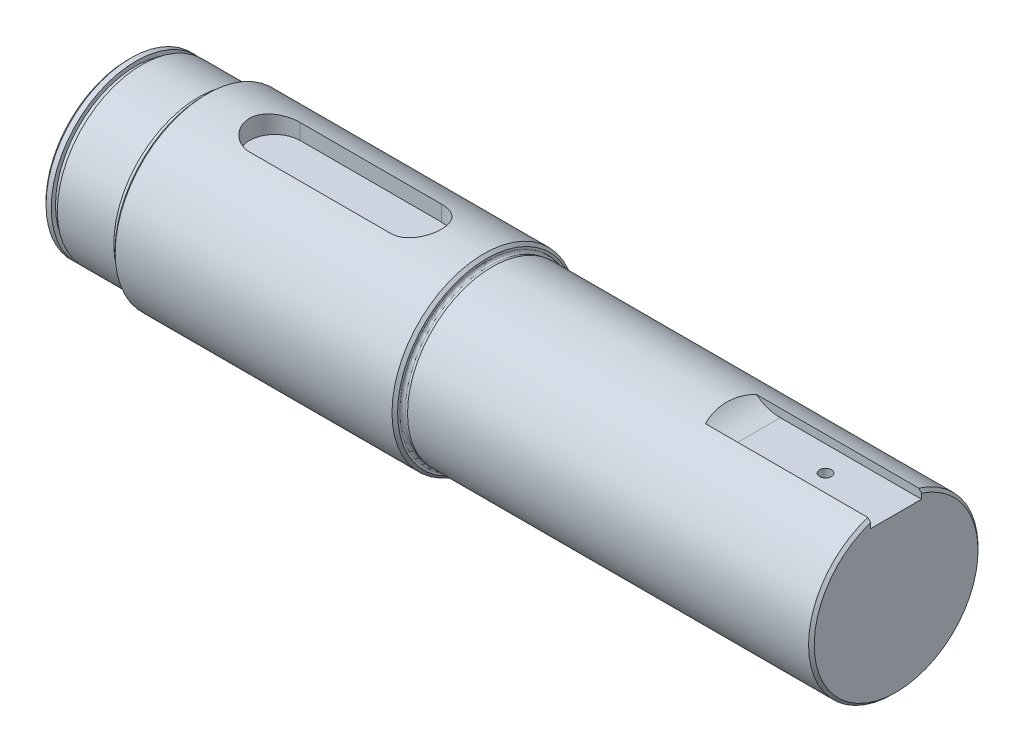
ISO-10303-21;
HEADER;
FILE_DESCRIPTION(('STEP AP214'),'2;1');
FILE_NAME('part.step','',(''),(''),'','','');
FILE_SCHEMA(('AUTOMOTIVE_DESIGN { 1 0 10303 214 1 1 1 1 }'));
ENDSEC;
DATA;
#1=APPLICATION_CONTEXT('core data for automotive mechanical design processes');
#2=APPLICATION_PROTOCOL_DEFINITION('international standard','automotive_design',2000,#1);
#3=PRODUCT_CONTEXT('',#1,'mechanical');
#4=PRODUCT('Part','Part','',(#3));
#5=PRODUCT_RELATED_PRODUCT_CATEGORY('part','',(#4));
#6=PRODUCT_DEFINITION_FORMATION('','',#4);
#7=PRODUCT_DEFINITION_CONTEXT('part definition',#1,'design');
#8=PRODUCT_DEFINITION('design','',#6,#7);
#9=PRODUCT_DEFINITION_SHAPE('','',#8);
#10=(LENGTH_UNIT() NAMED_UNIT(*) SI_UNIT(.MILLI.,.METRE.));
#11=(NAMED_UNIT(*) PLANE_ANGLE_UNIT() SI_UNIT($,.RADIAN.));
#12=(NAMED_UNIT(*) SI_UNIT($,.STERADIAN.) SOLID_ANGLE_UNIT());
#13=UNCERTAINTY_MEASURE_WITH_UNIT(LENGTH_MEASURE(1.E-05),#10,'distance_accuracy_value','');
#14=(GEOMETRIC_REPRESENTATION_CONTEXT(3) GLOBAL_UNCERTAINTY_ASSIGNED_CONTEXT((#13)) GLOBAL_UNIT_ASSIGNED_CONTEXT((#10,
#11,#12)) REPRESENTATION_CONTEXT('',''));
#15=CARTESIAN_POINT('',(0.,0.,0.));
#16=DIRECTION('',(0.,0.,1.));
#17=DIRECTION('',(1.,0.,0.));
#18=AXIS2_PLACEMENT_3D('',#15,#16,#17);
#19=CARTESIAN_POINT('',(0.,0.,0.));
#20=DIRECTION('',(-1.,0.,0.));
#21=DIRECTION('',(0.,0.,1.));
#22=AXIS2_PLACEMENT_3D('',#19,#20,#21);
#23=CYLINDRICAL_SURFACE('',#22,30.);
#24=CARTESIAN_POINT('',(129.,0.,0.));
#25=DIRECTION('',(-1.,0.,0.));
#26=DIRECTION('',(0.,0.,1.));
#27=AXIS2_PLACEMENT_3D('',#24,#25,#26);
#28=CIRCLE('',#27,30.);
#29=CARTESIAN_POINT('',(129.,0.,30.));
#30=VERTEX_POINT('',#29);
#31=EDGE_CURVE('E162',#30,#30,#28,.T.);
#32=ORIENTED_EDGE('',*,*,#31,.F.);
#33=EDGE_LOOP('',(#32));
#34=FACE_BOUND('',#33,.T.);
#35=CARTESIAN_POINT('',(213.520792212959,28.6181760425084,9.00000000000001));
#36=CARTESIAN_POINT('',(213.41512645861,28.7007156872793,8.73759997022524));
#37=CARTESIAN_POINT('',(213.316235185046,28.7803764629053,8.4716266488189));
#38=CARTESIAN_POINT('',(213.131141855778,28.9333022456182,7.93359478021795));
#39=CARTESIAN_POINT('',(213.044935632011,29.0065693503068,7.66153826584176));
#40=CARTESIAN_POINT('',(212.884396786674,29.1460271606617,7.11261209864792));
#41=CARTESIAN_POINT('',(212.810047697476,29.2122276376869,6.83574972394916));
#42=CARTESIAN_POINT('',(212.672304220804,29.3372247548397,6.27766419252651));
#43=CARTESIAN_POINT('',(212.608910811186,29.3960207339474,5.99644064898263));
#44=CARTESIAN_POINT('',(212.434174876651,29.5606691268056,5.14767095785582));
#45=CARTESIAN_POINT('',(212.338158212997,29.6548879525876,4.57461107877701));
#46=CARTESIAN_POINT('',(212.182727005431,29.8102366878741,3.41907090995409));
#47=CARTESIAN_POINT('',(212.123325305333,29.8713549854473,2.8365873880245));
#48=CARTESIAN_POINT('',(212.042406575524,29.9552995747608,1.7213067555248));
#49=CARTESIAN_POINT('',(212.017868188462,29.9811702977738,1.18895274473163));
#50=CARTESIAN_POINT('',(211.995741052725,30.0044811082398,0.123154495485694));
#51=CARTESIAN_POINT('',(211.998147588001,30.0019261709105,-0.41028953584476));
#52=CARTESIAN_POINT('',(212.029973056029,29.9684481603819,-1.47496980294091));
#53=CARTESIAN_POINT('',(212.059366296493,29.9375520689801,-2.0062076559313));
#54=CARTESIAN_POINT('',(212.146251116825,29.8478341203624,-3.06405843122353));
#55=CARTESIAN_POINT('',(212.203742344578,29.7890126130988,-3.59067141139855));
#56=CARTESIAN_POINT('',(212.335181289374,29.6580901807897,-4.5365644939186));
#57=CARTESIAN_POINT('',(212.403924912068,29.590637595133,-4.95722244322372));
#58=CARTESIAN_POINT('',(212.562924934138,29.4387597754027,-5.7912772756486));
#59=CARTESIAN_POINT('',(212.653173541685,29.3543406904747,-6.20467673059964));
#60=CARTESIAN_POINT('',(212.806288414275,29.2157881757844,-6.81775197717918));
#61=CARTESIAN_POINT('',(212.860311236625,29.1675929783489,-7.02102717837561));
#62=CARTESIAN_POINT('',(212.97458572877,29.0674122462138,-7.42487765645053));
#63=CARTESIAN_POINT('',(213.034837133388,29.0154268729051,-7.62545304786033));
#64=CARTESIAN_POINT('',(213.161955737294,28.9078242652556,-8.02373151832515));
#65=CARTESIAN_POINT('',(213.228829009663,28.8522037131921,-8.22143176636821));
#66=CARTESIAN_POINT('',(213.369516072757,28.7376258550389,-8.61339910091083));
#67=CARTESIAN_POINT('',(213.443330909472,28.6786680466088,-8.80766566474908));
#68=CARTESIAN_POINT('',(213.520792212959,28.6181760425084,-8.99999999999999));
#69=B_SPLINE_CURVE_WITH_KNOTS('',3,(#35,#36,#37,#38,#39,#40,#41,#42,#43,#44,#45,#46,#47,#48,#49,
#50,#51,#52,#53,#54,#55,#56,#57,#58,#59,#60,#61,#62,#63,#64,#65,#66,#67,#68),.UNSPECIFIED.,.F.,
.F.,(4,2,2,2,2,2,2,2,2,2,2,2,2,2,2,2,4),(0.,0.88382474296632,1.76735842665679,2.64965413400351,
3.5320285505446,5.29545024150545,7.05949015491315,8.65869475464728,10.2576194570743,
11.8550235037998,13.4524075329028,14.7462081951622,16.0395407898494,16.6867739753862,
17.333979616915,17.9817844236477,18.629687001827),.UNSPECIFIED.);
#70=CARTESIAN_POINT('',(213.520792212959,28.6181760425084,9.00000000000001));
#71=VERTEX_POINT('',#70);
#72=CARTESIAN_POINT('',(213.520792212959,28.6181760425084,-8.99999999999999));
#73=VERTEX_POINT('',#72);
#74=EDGE_CURVE('E138',#71,#73,#69,.T.);
#75=ORIENTED_EDGE('',*,*,#74,.T.);
#76=DIRECTION('',(-1.,0.,0.));
#77=VECTOR('',#76,1.);
#78=CARTESIAN_POINT('',(0.,28.6181760425084,-8.99999999999996));
#79=LINE('',#78,#77);
#80=CARTESIAN_POINT('',(271.,28.6181760425084,-9.));
#81=VERTEX_POINT('',#80);
#82=EDGE_CURVE('E136',#73,#81,#79,.F.);
#83=ORIENTED_EDGE('',*,*,#82,.T.);
#84=CARTESIAN_POINT('',(271.,0.,0.));
#85=DIRECTION('',(-1.,0.,0.));
#86=DIRECTION('',(0.,0.,1.));
#87=AXIS2_PLACEMENT_3D('',#84,#85,#86);
#88=CIRCLE('',#87,30.);
#89=CARTESIAN_POINT('',(271.,28.6181760425084,9.00000000000001));
#90=VERTEX_POINT('',#89);
#91=EDGE_CURVE('E316',#81,#90,#88,.T.);
#92=ORIENTED_EDGE('',*,*,#91,.T.);
#93=DIRECTION('',(-1.,0.,0.));
#94=VECTOR('',#93,1.);
#95=CARTESIAN_POINT('',(0.,28.6181760425084,9.));
#96=LINE('',#95,#94);
#97=EDGE_CURVE('E65',#90,#71,#96,.T.);
#98=ORIENTED_EDGE('',*,*,#97,.T.);
#99=EDGE_LOOP('',(#75,#83,#92,#98));
#100=FACE_BOUND('',#99,.T.);
#101=ADVANCED_FACE('F40',(#34,#100),#23,.T.);
#102=CARTESIAN_POINT('',(0.,0.,0.));
#103=DIRECTION('',(-1.,0.,0.));
#104=DIRECTION('',(0.,0.,1.));
#105=AXIS2_PLACEMENT_3D('',#102,#103,#104);
#106=CYLINDRICAL_SURFACE('',#105,32.5);
#107=CARTESIAN_POINT('',(126.,0.,0.));
#108=DIRECTION('',(-1.,0.,0.));
#109=DIRECTION('',(0.,0.,1.));
#110=AXIS2_PLACEMENT_3D('',#107,#108,#109);
#111=CIRCLE('',#110,32.5);
#112=CARTESIAN_POINT('',(126.,0.,32.5));
#113=VERTEX_POINT('',#112);
#114=EDGE_CURVE('E336',#113,#113,#111,.T.);
#115=ORIENTED_EDGE('',*,*,#114,.T.);
#116=EDGE_LOOP('',(#115));
#117=FACE_BOUND('',#116,.T.);
#118=CARTESIAN_POINT('',(28.,0.,0.));
#119=DIRECTION('',(1.,0.,0.));
#120=DIRECTION('',(0.,0.,-1.));
#121=AXIS2_PLACEMENT_3D('',#118,#119,#120);
#122=CIRCLE('',#121,32.5);
#123=CARTESIAN_POINT('',(28.,0.,-32.5));
#124=VERTEX_POINT('',#123);
#125=EDGE_CURVE('E50',#124,#124,#122,.T.);
#126=ORIENTED_EDGE('',*,*,#125,.T.);
#127=EDGE_LOOP('',(#126));
#128=FACE_BOUND('',#127,.T.);
#129=CARTESIAN_POINT('',(52.0000000000001,31.2289929392544,9.));
#130=CARTESIAN_POINT('',(51.7520813871983,31.2289606677831,9.00003254120642));
#131=CARTESIAN_POINT('',(51.5041742710449,31.2319440905919,8.9897575276324));
#132=CARTESIAN_POINT('',(51.0102333472137,31.2437070446258,8.9488325880989));
#133=CARTESIAN_POINT('',(50.7641991798911,31.2524854331706,8.91818667896581));
#134=CARTESIAN_POINT('',(50.2763076459276,31.2755770686767,8.83685204990454));
#135=CARTESIAN_POINT('',(50.0344420913645,31.2898777529316,8.78620881616291));
#136=CARTESIAN_POINT('',(49.5560217740811,31.3235713531721,8.66532381217123));
#137=CARTESIAN_POINT('',(49.3194671180267,31.3429643713347,8.59508164866901));
#138=CARTESIAN_POINT('',(48.8533981726127,31.3862592722595,8.43561126403174));
#139=CARTESIAN_POINT('',(48.6238807346894,31.4101591033401,8.3463916798215));
#140=CARTESIAN_POINT('',(48.1732009112498,31.461790387754,8.14960684085239));
#141=CARTESIAN_POINT('',(47.9520416562481,31.4895232589714,8.0420347938471));
#142=CARTESIAN_POINT('',(47.5195446954963,31.5480356987832,7.80934245375164));
#143=CARTESIAN_POINT('',(47.3082082870163,31.5788156681272,7.68421985153639));
#144=CARTESIAN_POINT('',(46.8966840988879,31.6425741708953,7.4172988412538));
#145=CARTESIAN_POINT('',(46.6964968701592,31.6755528127869,7.2754996102116));
#146=CARTESIAN_POINT('',(46.3037943283544,31.743636491494,6.97253328578176));
#147=CARTESIAN_POINT('',(46.111582154782,31.778773680823,6.81098035953726));
#148=CARTESIAN_POINT('',(45.7413584023733,31.8494516056722,6.47242834802166));
#149=CARTESIAN_POINT('',(45.5633470134432,31.8849923465818,6.29542905625351));
#150=CARTESIAN_POINT('',(45.2226431448113,31.9555124771147,5.92708884749551));
#151=CARTESIAN_POINT('',(45.0599533961017,31.9904917657443,5.73574538461665));
#152=CARTESIAN_POINT('',(44.7510165927318,32.0589311251915,5.33996801643614));
#153=CARTESIAN_POINT('',(44.6047690774414,32.0923912385533,5.13553447810547));
#154=CARTESIAN_POINT('',(44.3272992935145,32.1574535686797,4.71116323977613));
#155=CARTESIAN_POINT('',(44.1963876366047,32.189012591558,4.49101563579996));
#156=CARTESIAN_POINT('',(43.9536821091894,32.2487115230329,4.04008692762464));
#157=CARTESIAN_POINT('',(43.8418808522265,32.2768527514356,3.80930997581143));
#158=CARTESIAN_POINT('',(43.6382306290989,32.3289265315972,3.33864660857699));
#159=CARTESIAN_POINT('',(43.5463819502587,32.3528590227478,3.09876006203267));
#160=CARTESIAN_POINT('',(43.3834220012323,32.395821219672,2.61161705911825));
#161=CARTESIAN_POINT('',(43.312310132196,32.4148510670252,2.36436081580205));
#162=CARTESIAN_POINT('',(43.1929426443141,32.4470497559889,1.87047796552915));
#163=CARTESIAN_POINT('',(43.1441679478775,32.4603512235415,1.62398540848315));
#164=CARTESIAN_POINT('',(43.0673794930087,32.4813845435906,1.12755153516564));
#165=CARTESIAN_POINT('',(43.0393654269564,32.4891164786136,0.877610270051179));
#166=CARTESIAN_POINT('',(43.0043541931919,32.4987901278031,0.376181946118021));
#167=CARTESIAN_POINT('',(42.9973541957699,32.5007326215633,0.124695099994478));
#168=CARTESIAN_POINT('',(43.0044276055667,32.4987739790775,-0.37795716460729));
#169=CARTESIAN_POINT('',(43.0185006874852,32.4948729330369,-0.629122587987342));
#170=CARTESIAN_POINT('',(43.0669161025447,32.4815250189966,-1.12237836370317));
#171=CARTESIAN_POINT('',(43.1006922235657,32.4722331089392,-1.36452874801715));
#172=CARTESIAN_POINT('',(43.1877819294401,32.4484735094411,-1.84512110492827));
#173=CARTESIAN_POINT('',(43.2411025274598,32.4340039621474,-2.08356171428676));
#174=CARTESIAN_POINT('',(43.3668270199801,32.4002779776373,-2.55496018128279));
#175=CARTESIAN_POINT('',(43.4392274753444,32.3810224031359,-2.78791901877257));
#176=CARTESIAN_POINT('',(43.6025443307516,32.3382290100125,-3.24685492263031));
#177=CARTESIAN_POINT('',(43.6934616122015,32.3146909875503,-3.4728316560579));
#178=CARTESIAN_POINT('',(43.8941660170747,32.2636797405897,-3.91865260825399));
#179=CARTESIAN_POINT('',(44.0041402958348,32.2361679851731,-4.13840813289177));
#180=CARTESIAN_POINT('',(44.2414869981748,32.1781181581967,-4.56789651609238));
#181=CARTESIAN_POINT('',(44.3688598778041,32.1475800073152,-4.7776291117411));
#182=CARTESIAN_POINT('',(44.6401387405158,32.0842666304487,-5.1857978878534));
#183=CARTESIAN_POINT('',(44.7840470754761,32.0514910865036,-5.38423245535356));
#184=CARTESIAN_POINT('',(45.0874356870835,31.9845534457089,-5.76856991317805));
#185=CARTESIAN_POINT('',(45.2469163512817,31.9503913143634,-5.95447249142205));
#186=CARTESIAN_POINT('',(45.5859457053321,31.8804279906808,-6.31852809120604));
#187=CARTESIAN_POINT('',(45.7659827394682,31.8446098973284,-6.49622340355862));
#188=CARTESIAN_POINT('',(46.1404179579981,31.7734311294993,-6.83587530256207));
#189=CARTESIAN_POINT('',(46.3348161158936,31.7380704541786,-6.99783191825176));
#190=CARTESIAN_POINT('',(46.7367861570323,31.6687894031617,-7.30496931526172));
#191=CARTESIAN_POINT('',(46.9443621955815,31.6348694874559,-7.45014476395827));
#192=CARTESIAN_POINT('',(47.3712795260323,31.5694562764722,-7.72263364792263));
#193=CARTESIAN_POINT('',(47.5906203559017,31.5379628860169,-7.84994778393898));
#194=CARTESIAN_POINT('',(48.0414024387571,31.4780909385547,-8.08670686667952));
#195=CARTESIAN_POINT('',(48.2729255503908,31.4497389351468,-8.19600280618205));
#196=CARTESIAN_POINT('',(48.7447657226766,31.3973185548467,-8.39457780014711));
#197=CARTESIAN_POINT('',(48.9850791827044,31.3732484472146,-8.48386494596037));
#198=CARTESIAN_POINT('',(49.4726047605272,31.3301586945376,-8.64163454453783));
#199=CARTESIAN_POINT('',(49.7198094018813,31.3111337947239,-8.71013865439533));
#200=CARTESIAN_POINT('',(50.2194165944527,31.2787206987159,-8.82582765804677));
#201=CARTESIAN_POINT('',(50.4718166737418,31.2653298840688,-8.8730224561355));
#202=CARTESIAN_POINT('',(50.9368574432652,31.2463738150635,-8.93952721305507));
#203=CARTESIAN_POINT('',(51.1489843519563,31.2398667435002,-8.9622081178801));
#204=CARTESIAN_POINT('',(51.5740685376472,31.2311713034268,-8.99244047141394));
#205=CARTESIAN_POINT('',(51.7870240074454,31.2289762262702,-9.00001542240496));
#206=CARTESIAN_POINT('',(52.0000000000001,31.2289929392544,-8.99999999999999));
#207=B_SPLINE_CURVE_WITH_KNOTS('',3,(#129,#130,#131,#132,#133,#134,#135,#136,#137,#138,#139,
#140,#141,#142,#143,#144,#145,#146,#147,#148,#149,#150,#151,#152,#153,#154,#155,#156,#157,#158,
#159,#160,#161,#162,#163,#164,#165,#166,#167,#168,#169,#170,#171,#172,#173,#174,#175,#176,#177,
#178,#179,#180,#181,#182,#183,#184,#185,#186,#187,#188,#189,#190,#191,#192,#193,#194,#195,#196,
#197,#198,#199,#200,#201,#202,#203,#204,#205,#206),.UNSPECIFIED.,.F.,.F.,(4,2,2,2,2,2,2,2,2,2,2,
2,2,2,2,2,2,2,2,2,2,2,2,2,2,2,2,2,2,2,2,2,2,2,2,2,2,2,4),(0.,0.743507424823849,1.4868682849246,
2.22854793738108,2.97024247269644,3.71160017058671,4.45323284254393,5.19496318273706,
5.93673014194844,6.69645817811063,7.45619637236746,8.21606973020113,8.97592179484206,
9.74917985564462,10.5221383613939,11.2951079972929,12.0680553086962,12.8219941896154,
13.5759218988405,14.3297480812114,15.0835626270632,15.8167130123661,16.5501267327861,
17.2834083459999,18.0167248718196,18.7576999698018,19.4986944938414,20.2397945420905,
20.9809130389171,21.7464708911625,22.5120273308822,23.2778263798469,24.0435953759965,
24.8154099007903,25.5869117462188,26.3576068598481,27.1279433946042,27.7676829902253,
28.406426481422),.UNSPECIFIED.);
#208=CARTESIAN_POINT('',(52.0000000000001,31.2289929392544,9.00000000000001));
#209=VERTEX_POINT('',#208);
#210=CARTESIAN_POINT('',(52.0000000000001,31.2289929392544,-8.99999999999998));
#211=VERTEX_POINT('',#210);
#212=EDGE_CURVE('E187',#209,#211,#207,.T.);
#213=ORIENTED_EDGE('',*,*,#212,.T.);
#214=DIRECTION('',(-1.,0.,0.));
#215=VECTOR('',#214,1.);
#216=CARTESIAN_POINT('',(0.,31.2289929392544,-8.99999999999998));
#217=LINE('',#216,#215);
#218=CARTESIAN_POINT('',(102.,31.2289929392544,-8.99999999999998));
#219=VERTEX_POINT('',#218);
#220=EDGE_CURVE('E257',#211,#219,#217,.F.);
#221=ORIENTED_EDGE('',*,*,#220,.T.);
#222=CARTESIAN_POINT('',(102.,31.2289929392544,-9.00000000000001));
#223=CARTESIAN_POINT('',(102.247918612802,31.2289606677831,-9.00003254120643));
#224=CARTESIAN_POINT('',(102.495825728955,31.2319440905919,-8.98975752763241));
#225=CARTESIAN_POINT('',(102.989766652786,31.2437070446258,-8.9488325880989));
#226=CARTESIAN_POINT('',(103.235800820109,31.2524854331706,-8.91818667896582));
#227=CARTESIAN_POINT('',(103.723692354073,31.2755770686767,-8.83685204990454));
#228=CARTESIAN_POINT('',(103.965557908636,31.2898777529316,-8.78620881616291));
#229=CARTESIAN_POINT('',(104.443978225919,31.3235713531721,-8.66532381217123));
#230=CARTESIAN_POINT('',(104.680532881973,31.3429643713347,-8.59508164866901));
#231=CARTESIAN_POINT('',(105.146601827387,31.3862592722595,-8.43561126403174));
#232=CARTESIAN_POINT('',(105.376119265311,31.4101591033401,-8.3463916798215));
#233=CARTESIAN_POINT('',(105.82679908875,31.461790387754,-8.1496068408524));
#234=CARTESIAN_POINT('',(106.047958343752,31.4895232589714,-8.0420347938471));
#235=CARTESIAN_POINT('',(106.480455304504,31.5480356987832,-7.80934245375165));
#236=CARTESIAN_POINT('',(106.691791712984,31.5788156681272,-7.68421985153639));
#237=CARTESIAN_POINT('',(107.103315901112,31.6425741708953,-7.41729884125381));
#238=CARTESIAN_POINT('',(107.303503129841,31.6755528127869,-7.2754996102116));
#239=CARTESIAN_POINT('',(107.696205671646,31.743636491494,-6.97253328578176));
#240=CARTESIAN_POINT('',(107.888417845218,31.778773680823,-6.81098035953726));
#241=CARTESIAN_POINT('',(108.258641597627,31.8494516056722,-6.47242834802166));
#242=CARTESIAN_POINT('',(108.436652986557,31.8849923465818,-6.29542905625351));
#243=CARTESIAN_POINT('',(108.777356855189,31.9555124771147,-5.92708884749551));
#244=CARTESIAN_POINT('',(108.940046603898,31.9904917657443,-5.73574538461666));
#245=CARTESIAN_POINT('',(109.248983407268,32.0589311251915,-5.33996801643614));
#246=CARTESIAN_POINT('',(109.395230922559,32.0923912385533,-5.13553447810548));
#247=CARTESIAN_POINT('',(109.672700706486,32.1574535686797,-4.71116323977613));
#248=CARTESIAN_POINT('',(109.803612363395,32.189012591558,-4.49101563579996));
#249=CARTESIAN_POINT('',(110.046317890811,32.2487115230329,-4.04008692762464));
#250=CARTESIAN_POINT('',(110.158119147774,32.2768527514356,-3.80930997581143));
#251=CARTESIAN_POINT('',(110.361769370901,32.3289265315972,-3.33864660857698));
#252=CARTESIAN_POINT('',(110.453618049741,32.3528590227478,-3.09876006203266));
#253=CARTESIAN_POINT('',(110.616577998768,32.395821219672,-2.61161705911825));
#254=CARTESIAN_POINT('',(110.687689867804,32.4148510670252,-2.36436081580205));
#255=CARTESIAN_POINT('',(110.807057355686,32.4470497559889,-1.87047796552915));
#256=CARTESIAN_POINT('',(110.855832052123,32.4603512235415,-1.62398540848315));
#257=CARTESIAN_POINT('',(110.932620506991,32.4813845435906,-1.12755153516564));
#258=CARTESIAN_POINT('',(110.960634573044,32.4891164786136,-0.877610270051177));
#259=CARTESIAN_POINT('',(110.995645806808,32.4987901278031,-0.376181946118021));
#260=CARTESIAN_POINT('',(111.00264580423,32.5007326215633,-0.124695099994479));
#261=CARTESIAN_POINT('',(110.995572394433,32.4987739790775,0.377957164607288));
#262=CARTESIAN_POINT('',(110.981499312515,32.4948729330369,0.629122587987339));
#263=CARTESIAN_POINT('',(110.933083897455,32.4815250189966,1.12237836370317));
#264=CARTESIAN_POINT('',(110.899307776434,32.4722331089392,1.36452874801715));
#265=CARTESIAN_POINT('',(110.81221807056,32.4484735094411,1.84512110492827));
#266=CARTESIAN_POINT('',(110.75889747254,32.4340039621474,2.08356171428676));
#267=CARTESIAN_POINT('',(110.63317298002,32.4002779776373,2.55496018128279));
#268=CARTESIAN_POINT('',(110.560772524656,32.3810224031359,2.78791901877257));
#269=CARTESIAN_POINT('',(110.397455669249,32.3382290100125,3.24685492263031));
#270=CARTESIAN_POINT('',(110.306538387799,32.3146909875503,3.4728316560579));
#271=CARTESIAN_POINT('',(110.105833982925,32.2636797405897,3.91865260825399));
#272=CARTESIAN_POINT('',(109.995859704165,32.2361679851731,4.13840813289177));
#273=CARTESIAN_POINT('',(109.758513001825,32.1781181581967,4.56789651609237));
#274=CARTESIAN_POINT('',(109.631140122196,32.1475800073152,4.7776291117411));
#275=CARTESIAN_POINT('',(109.359861259484,32.0842666304487,5.18579788785341));
#276=CARTESIAN_POINT('',(109.215952924524,32.0514910865036,5.38423245535357));
#277=CARTESIAN_POINT('',(108.912564312917,31.9845534457089,5.76856991317806));
#278=CARTESIAN_POINT('',(108.753083648718,31.9503913143634,5.95447249142205));
#279=CARTESIAN_POINT('',(108.414054294668,31.8804279906808,6.31852809120604));
#280=CARTESIAN_POINT('',(108.234017260532,31.8446098973284,6.49622340355862));
#281=CARTESIAN_POINT('',(107.859582042002,31.7734311294993,6.83587530256207));
#282=CARTESIAN_POINT('',(107.665183884106,31.7380704541786,6.99783191825176));
#283=CARTESIAN_POINT('',(107.263213842968,31.6687894031617,7.30496931526172));
#284=CARTESIAN_POINT('',(107.055637804419,31.6348694874559,7.45014476395827));
#285=CARTESIAN_POINT('',(106.628720473968,31.5694562764722,7.72263364792263));
#286=CARTESIAN_POINT('',(106.409379644098,31.5379628860169,7.84994778393898));
#287=CARTESIAN_POINT('',(105.958597561243,31.4780909385547,8.08670686667951));
#288=CARTESIAN_POINT('',(105.727074449609,31.4497389351469,8.19600280618204));
#289=CARTESIAN_POINT('',(105.255234277323,31.3973185548467,8.3945778001471));
#290=CARTESIAN_POINT('',(105.014920817296,31.3732484472146,8.48386494596036));
#291=CARTESIAN_POINT('',(104.527395239473,31.3301586945376,8.64163454453783));
#292=CARTESIAN_POINT('',(104.280190598119,31.3111337947238,8.71013865439533));
#293=CARTESIAN_POINT('',(103.780583405547,31.2787206987159,8.82582765804677));
#294=CARTESIAN_POINT('',(103.528183326258,31.2653298840688,8.8730224561355));
#295=CARTESIAN_POINT('',(103.063142556735,31.2463738150635,8.93952721305507));
#296=CARTESIAN_POINT('',(102.851015648044,31.2398667435002,8.9622081178801));
#297=CARTESIAN_POINT('',(102.425931462353,31.2311713034268,8.99244047141394));
#298=CARTESIAN_POINT('',(102.212975992555,31.2289762262702,9.00001542240495));
#299=CARTESIAN_POINT('',(102.,31.2289929392544,8.99999999999999));
#300=B_SPLINE_CURVE_WITH_KNOTS('',3,(#222,#223,#224,#225,#226,#227,#228,#229,#230,#231,#232,
#233,#234,#235,#236,#237,#238,#239,#240,#241,#242,#243,#244,#245,#246,#247,#248,#249,#250,#251,
#252,#253,#254,#255,#256,#257,#258,#259,#260,#261,#262,#263,#264,#265,#266,#267,#268,#269,#270,
#271,#272,#273,#274,#275,#276,#277,#278,#279,#280,#281,#282,#283,#284,#285,#286,#287,#288,#289,
#290,#291,#292,#293,#294,#295,#296,#297,#298,#299),.UNSPECIFIED.,.F.,.F.,(4,2,2,2,2,2,2,2,2,2,2,
2,2,2,2,2,2,2,2,2,2,2,2,2,2,2,2,2,2,2,2,2,2,2,2,2,2,2,4),(0.,0.743507424823849,1.48686828492459,
2.22854793738106,2.97024247269643,3.7116001705867,4.45323284254391,5.19496318273704,
5.93673014194842,6.69645817811061,7.45619637236745,8.21606973020111,8.97592179484204,
9.74917985564461,10.5221383613939,11.2951079972929,12.0680553086962,12.8219941896153,
13.5759218988404,14.3297480812114,15.0835626270632,15.8167130123661,16.5501267327861,
17.2834083459999,18.0167248718195,18.7576999698018,19.4986944938414,20.2397945420905,
20.9809130389171,21.7464708911625,22.5120273308821,23.2778263798469,24.0435953759964,
24.8154099007903,25.5869117462188,26.3576068598481,27.1279433946042,27.7676829902253,
28.406426481422),.UNSPECIFIED.);
#301=CARTESIAN_POINT('',(102.,31.2289929392544,8.99999999999999));
#302=VERTEX_POINT('',#301);
#303=EDGE_CURVE('E163',#219,#302,#300,.T.);
#304=ORIENTED_EDGE('',*,*,#303,.T.);
#305=DIRECTION('',(-1.,0.,0.));
#306=VECTOR('',#305,1.);
#307=CARTESIAN_POINT('',(0.,31.2289929392544,9.00000000000001));
#308=LINE('',#307,#306);
#309=EDGE_CURVE('E173',#302,#209,#308,.T.);
#310=ORIENTED_EDGE('',*,*,#309,.T.);
#311=EDGE_LOOP('',(#213,#221,#304,#310));
#312=FACE_BOUND('',#311,.T.);
#313=ADVANCED_FACE('F208',(#117,#128,#312),#106,.T.);
#314=CARTESIAN_POINT('',(272.,30.,0.));
#315=DIRECTION('',(-1.,0.,0.));
#316=DIRECTION('',(0.,0.,1.));
#317=AXIS2_PLACEMENT_3D('',#314,#315,#316);
#318=PLANE('',#317);
#319=DIRECTION('',(0.,-1.,0.));
#320=VECTOR('',#319,1.);
#321=CARTESIAN_POINT('',(272.,32.501,-9.));
#322=LINE('',#321,#320);
#323=CARTESIAN_POINT('',(272.,27.5680975041804,-9.));
#324=VERTEX_POINT('',#323);
#325=CARTESIAN_POINT('',(272.,25.7,-9.));
#326=VERTEX_POINT('',#325);
#327=EDGE_CURVE('E157',#324,#326,#322,.T.);
#328=ORIENTED_EDGE('',*,*,#327,.T.);
#329=DIRECTION('',(0.,0.,-1.));
#330=VECTOR('',#329,1.);
#331=CARTESIAN_POINT('',(272.,25.7,9.00000000000001));
#332=LINE('',#331,#330);
#333=CARTESIAN_POINT('',(272.,25.7,9.00000000000001));
#334=VERTEX_POINT('',#333);
#335=EDGE_CURVE('E142',#334,#326,#332,.T.);
#336=ORIENTED_EDGE('',*,*,#335,.F.);
#337=DIRECTION('',(0.,-1.,0.));
#338=VECTOR('',#337,1.);
#339=CARTESIAN_POINT('',(272.,32.501,9.00000000000001));
#340=LINE('',#339,#338);
#341=CARTESIAN_POINT('',(272.,27.5680975041804,9.00000000000001));
#342=VERTEX_POINT('',#341);
#343=EDGE_CURVE('E154',#342,#334,#340,.T.);
#344=ORIENTED_EDGE('',*,*,#343,.F.);
#345=CARTESIAN_POINT('',(272.,0.,0.));
#346=DIRECTION('',(-1.,0.,0.));
#347=DIRECTION('',(0.,0.,1.));
#348=AXIS2_PLACEMENT_3D('',#345,#346,#347);
#349=CIRCLE('',#348,29.);
#350=EDGE_CURVE('E320',#342,#324,#349,.F.);
#351=ORIENTED_EDGE('',*,*,#350,.T.);
#352=EDGE_LOOP('',(#328,#336,#344,#351));
#353=FACE_BOUND('',#352,.T.);
#354=ADVANCED_FACE('F204',(#353),#318,.F.);
#355=CARTESIAN_POINT('',(271.,0.,0.));
#356=DIRECTION('',(-1.,0.,0.));
#357=DIRECTION('',(0.,0.,1.));
#358=AXIS2_PLACEMENT_3D('',#355,#356,#357);
#359=CONICAL_SURFACE('',#358,30.,0.785398163397436);
#360=ORIENTED_EDGE('',*,*,#91,.F.);
#361=CARTESIAN_POINT('',(276.414948010929,22.8784785618567,-9.));
#362=CARTESIAN_POINT('',(276.009987828362,23.3136328546534,-9.));
#363=CARTESIAN_POINT('',(275.604212490511,23.7480268960559,-9.));
#364=CARTESIAN_POINT('',(274.791242546304,24.6154827042335,-9.));
#365=CARTESIAN_POINT('',(274.384047944069,25.0485444748699,-9.));
#366=CARTESIAN_POINT('',(273.160664385168,26.3460004096959,-9.));
#367=CARTESIAN_POINT('',(272.34265965646,27.2086823782976,-9.));
#368=CARTESIAN_POINT('',(270.703002736618,28.9305545480583,-9.));
#369=CARTESIAN_POINT('',(269.8813505786,29.7897447807841,-9.));
#370=CARTESIAN_POINT('',(268.646733193309,31.0764928918173,-9.));
#371=CARTESIAN_POINT('',(268.234833341881,31.5050737357905,-9.));
#372=CARTESIAN_POINT('',(267.410399445261,32.3616244086466,-9.));
#373=CARTESIAN_POINT('',(266.997865400559,32.7895942380006,-9.));
#374=CARTESIAN_POINT('',(266.585051989071,33.2172943900452,-9.));
#375=B_SPLINE_CURVE_WITH_KNOTS('',3,(#361,#362,#363,#364,#365,#366,#367,#368,#369,#370,#371,
#372,#373,#374),.UNSPECIFIED.,.F.,.F.,(4,2,2,2,2,2,4),(0.,1.78329968203344,3.56659419065892,
7.13311273528642,10.6995989648882,12.4828783380346,14.2661563356581),.UNSPECIFIED.);
#376=EDGE_CURVE('E146',#324,#81,#375,.T.);
#377=ORIENTED_EDGE('',*,*,#376,.F.);
#378=ORIENTED_EDGE('',*,*,#350,.F.);
#379=CARTESIAN_POINT('',(266.585051989071,33.2172943900452,9.00000000000001));
#380=CARTESIAN_POINT('',(266.997865400559,32.7895942380005,9.00000000000001));
#381=CARTESIAN_POINT('',(267.410399445261,32.3616244086466,9.00000000000001));
#382=CARTESIAN_POINT('',(268.234833341881,31.5050737357905,9.00000000000001));
#383=CARTESIAN_POINT('',(268.646733193309,31.0764928918174,9.00000000000001));
#384=CARTESIAN_POINT('',(269.8813505786,29.7897447807841,9.00000000000001));
#385=CARTESIAN_POINT('',(270.703002736618,28.9305545480583,9.00000000000001));
#386=CARTESIAN_POINT('',(272.34265965646,27.2086823782976,9.00000000000001));
#387=CARTESIAN_POINT('',(273.160664385168,26.3460004096959,9.00000000000001));
#388=CARTESIAN_POINT('',(274.384047944069,25.0485444748699,9.00000000000001));
#389=CARTESIAN_POINT('',(274.791242546304,24.6154827042335,9.00000000000001));
#390=CARTESIAN_POINT('',(275.604212490511,23.7480268960559,9.00000000000001));
#391=CARTESIAN_POINT('',(276.009987828362,23.3136328546534,9.00000000000001));
#392=CARTESIAN_POINT('',(276.414948010929,22.8784785618567,9.00000000000001));
#393=B_SPLINE_CURVE_WITH_KNOTS('',3,(#379,#380,#381,#382,#383,#384,#385,#386,#387,#388,#389,
#390,#391,#392),.UNSPECIFIED.,.F.,.F.,(4,2,2,2,2,2,4),(0.,1.78327799762344,3.56655737076982,
7.13304360037164,10.6995621449991,12.4828566536246,14.2661563356581),.UNSPECIFIED.);
#394=EDGE_CURVE('E245',#90,#342,#393,.T.);
#395=ORIENTED_EDGE('',*,*,#394,.F.);
#396=EDGE_LOOP('',(#360,#377,#378,#395));
#397=FACE_BOUND('',#396,.T.);
#398=ADVANCED_FACE('F207',(#397),#359,.T.);
#399=CARTESIAN_POINT('',(0.,0.,0.));
#400=DIRECTION('',(1.,0.,0.));
#401=DIRECTION('',(0.,0.,-1.));
#402=AXIS2_PLACEMENT_3D('',#399,#400,#401);
#403=PLANE('',#402);
#404=CARTESIAN_POINT('',(0.,0.,0.));
#405=DIRECTION('',(1.,0.,0.));
#406=DIRECTION('',(0.,0.,-1.));
#407=AXIS2_PLACEMENT_3D('',#404,#405,#406);
#408=CIRCLE('',#407,29.);
#409=CARTESIAN_POINT('',(0.,0.,-29.));
#410=VERTEX_POINT('',#409);
#411=EDGE_CURVE('E324',#410,#410,#408,.F.);
#412=ORIENTED_EDGE('',*,*,#411,.T.);
#413=EDGE_LOOP('',(#412));
#414=FACE_BOUND('',#413,.T.);
#415=ADVANCED_FACE('F393',(#414),#403,.F.);
#416=CARTESIAN_POINT('',(0.,0.,0.));
#417=DIRECTION('',(-1.,0.,0.));
#418=DIRECTION('',(0.,0.,1.));
#419=AXIS2_PLACEMENT_3D('',#416,#417,#418);
#420=CYLINDRICAL_SURFACE('',#419,30.);
#421=CARTESIAN_POINT('',(0.999999999999938,0.,0.));
#422=DIRECTION('',(1.,0.,0.));
#423=DIRECTION('',(0.,0.,-1.));
#424=AXIS2_PLACEMENT_3D('',#421,#422,#423);
#425=CIRCLE('',#424,30.);
#426=CARTESIAN_POINT('',(0.999999999999938,0.,-30.));
#427=VERTEX_POINT('',#426);
#428=EDGE_CURVE('E328',#427,#427,#425,.T.);
#429=ORIENTED_EDGE('',*,*,#428,.T.);
#430=EDGE_LOOP('',(#429));
#431=FACE_BOUND('',#430,.T.);
#432=CARTESIAN_POINT('',(2.85000000000007,0.,0.));
#433=DIRECTION('',(-1.,0.,0.));
#434=DIRECTION('',(0.,0.,1.));
#435=AXIS2_PLACEMENT_3D('',#432,#433,#434);
#436=CIRCLE('',#435,30.);
#437=CARTESIAN_POINT('',(2.85000000000007,0.,30.));
#438=VERTEX_POINT('',#437);
#439=EDGE_CURVE('E312',#438,#438,#436,.T.);
#440=ORIENTED_EDGE('',*,*,#439,.T.);
#441=EDGE_LOOP('',(#440));
#442=FACE_BOUND('',#441,.T.);
#443=ADVANCED_FACE('F389',(#431,#442),#420,.T.);
#444=CARTESIAN_POINT('',(2.85000000000007,30.,0.));
#445=DIRECTION('',(-1.,0.,0.));
#446=DIRECTION('',(0.,0.,1.));
#447=AXIS2_PLACEMENT_3D('',#444,#445,#446);
#448=PLANE('',#447);
#449=ORIENTED_EDGE('',*,*,#439,.F.);
#450=EDGE_LOOP('',(#449));
#451=FACE_BOUND('',#450,.T.);
#452=CARTESIAN_POINT('',(2.85000000000007,0.,0.));
#453=DIRECTION('',(-1.,0.,0.));
#454=DIRECTION('',(0.,0.,1.));
#455=AXIS2_PLACEMENT_3D('',#452,#453,#454);
#456=CIRCLE('',#455,28.5);
#457=CARTESIAN_POINT('',(2.85000000000007,0.,28.5));
#458=VERTEX_POINT('',#457);
#459=EDGE_CURVE('E308',#458,#458,#456,.T.);
#460=ORIENTED_EDGE('',*,*,#459,.T.);
#461=EDGE_LOOP('',(#460));
#462=FACE_BOUND('',#461,.T.);
#463=ADVANCED_FACE('F385',(#451,#462),#448,.F.);
#464=CARTESIAN_POINT('',(0.,0.,0.));
#465=DIRECTION('',(-1.,0.,0.));
#466=DIRECTION('',(0.,0.,1.));
#467=AXIS2_PLACEMENT_3D('',#464,#465,#466);
#468=CYLINDRICAL_SURFACE('',#467,28.5);
#469=ORIENTED_EDGE('',*,*,#459,.F.);
#470=EDGE_LOOP('',(#469));
#471=FACE_BOUND('',#470,.T.);
#472=CARTESIAN_POINT('',(5.00000000000007,0.,0.));
#473=DIRECTION('',(-1.,0.,0.));
#474=DIRECTION('',(0.,0.,1.));
#475=AXIS2_PLACEMENT_3D('',#472,#473,#474);
#476=CIRCLE('',#475,28.5);
#477=CARTESIAN_POINT('',(5.00000000000007,0.,28.5));
#478=VERTEX_POINT('',#477);
#479=EDGE_CURVE('E304',#478,#478,#476,.T.);
#480=ORIENTED_EDGE('',*,*,#479,.T.);
#481=EDGE_LOOP('',(#480));
#482=FACE_BOUND('',#481,.T.);
#483=ADVANCED_FACE('F381',(#471,#482),#468,.T.);
#484=CARTESIAN_POINT('',(5.00000000000007,28.5,0.));
#485=DIRECTION('',(1.,0.,0.));
#486=DIRECTION('',(0.,0.,-1.));
#487=AXIS2_PLACEMENT_3D('',#484,#485,#486);
#488=PLANE('',#487);
#489=ORIENTED_EDGE('',*,*,#479,.F.);
#490=EDGE_LOOP('',(#489));
#491=FACE_BOUND('',#490,.T.);
#492=CARTESIAN_POINT('',(5.00000000000007,0.,0.));
#493=DIRECTION('',(-1.,0.,0.));
#494=DIRECTION('',(0.,0.,1.));
#495=AXIS2_PLACEMENT_3D('',#492,#493,#494);
#496=CIRCLE('',#495,30.);
#497=CARTESIAN_POINT('',(5.00000000000007,0.,30.));
#498=VERTEX_POINT('',#497);
#499=EDGE_CURVE('E300',#498,#498,#496,.T.);
#500=ORIENTED_EDGE('',*,*,#499,.T.);
#501=EDGE_LOOP('',(#500));
#502=FACE_BOUND('',#501,.T.);
#503=ADVANCED_FACE('F377',(#491,#502),#488,.F.);
#504=CARTESIAN_POINT('',(0.,0.,0.));
#505=DIRECTION('',(-1.,0.,0.));
#506=DIRECTION('',(0.,0.,1.));
#507=AXIS2_PLACEMENT_3D('',#504,#505,#506);
#508=CYLINDRICAL_SURFACE('',#507,30.);
#509=ORIENTED_EDGE('',*,*,#499,.F.);
#510=EDGE_LOOP('',(#509));
#511=FACE_BOUND('',#510,.T.);
#512=CARTESIAN_POINT('',(25.,0.,0.));
#513=DIRECTION('',(-1.,0.,0.));
#514=DIRECTION('',(0.,0.,1.));
#515=AXIS2_PLACEMENT_3D('',#512,#513,#514);
#516=CIRCLE('',#515,30.);
#517=CARTESIAN_POINT('',(25.,0.,30.));
#518=VERTEX_POINT('',#517);
#519=EDGE_CURVE('E296',#518,#518,#516,.T.);
#520=ORIENTED_EDGE('',*,*,#519,.T.);
#521=EDGE_LOOP('',(#520));
#522=FACE_BOUND('',#521,.T.);
#523=ADVANCED_FACE('F373',(#511,#522),#508,.T.);
#524=CARTESIAN_POINT('',(26.0451085773193,0.,0.));
#525=DIRECTION('',(-1.,0.,0.));
#526=DIRECTION('',(0.,0.,1.));
#527=AXIS2_PLACEMENT_3D('',#524,#525,#526);
#528=CONICAL_SURFACE('',#527,29.7199640007045,0.26179938779915);
#529=ORIENTED_EDGE('',*,*,#519,.F.);
#530=EDGE_LOOP('',(#529));
#531=FACE_BOUND('',#530,.T.);
#532=CARTESIAN_POINT('',(26.0451085773193,0.,0.));
#533=DIRECTION('',(-1.,0.,0.));
#534=DIRECTION('',(0.,0.,1.));
#535=AXIS2_PLACEMENT_3D('',#532,#533,#534);
#536=CIRCLE('',#535,29.7199640007045);
#537=CARTESIAN_POINT('',(26.0451085773193,0.,29.7199640007045));
#538=VERTEX_POINT('',#537);
#539=EDGE_CURVE('E292',#538,#538,#536,.T.);
#540=ORIENTED_EDGE('',*,*,#539,.T.);
#541=EDGE_LOOP('',(#540));
#542=FACE_BOUND('',#541,.T.);
#543=ADVANCED_FACE('F365',(#531,#542),#528,.T.);
#544=CARTESIAN_POINT('',(26.2521638134013,0.,0.));
#545=DIRECTION('',(-1.,0.,0.));
#546=DIRECTION('',(0.,0.,1.));
#547=AXIS2_PLACEMENT_3D('',#544,#545,#546);
#548=TOROIDAL_SURFACE('',#547,30.4927046617357,0.800000000000012);
#549=ORIENTED_EDGE('',*,*,#539,.F.);
#550=EDGE_LOOP('',(#549));
#551=FACE_BOUND('',#550,.T.);
#552=CARTESIAN_POINT('',(27.0249044744326,0.,0.));
#553=DIRECTION('',(-1.,0.,0.));
#554=DIRECTION('',(0.,0.,1.));
#555=AXIS2_PLACEMENT_3D('',#552,#553,#554);
#556=CIRCLE('',#555,30.6997598978177);
#557=CARTESIAN_POINT('',(27.0249044744326,0.,30.6997598978177));
#558=VERTEX_POINT('',#557);
#559=EDGE_CURVE('E288',#558,#558,#556,.T.);
#560=ORIENTED_EDGE('',*,*,#559,.T.);
#561=EDGE_LOOP('',(#560));
#562=FACE_BOUND('',#561,.T.);
#563=ADVANCED_FACE('F359',(#551,#562),#548,.F.);
#564=CARTESIAN_POINT('',(27.0000000000001,0.,0.));
#565=DIRECTION('',(-1.,0.,0.));
#566=DIRECTION('',(0.,0.,1.));
#567=AXIS2_PLACEMENT_3D('',#564,#565,#566);
#568=CONICAL_SURFACE('',#567,30.7927046617357,1.30899693899582);
#569=ORIENTED_EDGE('',*,*,#559,.F.);
#570=EDGE_LOOP('',(#569));
#571=FACE_BOUND('',#570,.T.);
#572=CARTESIAN_POINT('',(27.0000000000001,0.,0.));
#573=DIRECTION('',(-1.,0.,0.));
#574=DIRECTION('',(0.,0.,1.));
#575=AXIS2_PLACEMENT_3D('',#572,#573,#574);
#576=CIRCLE('',#575,30.7927046617357);
#577=CARTESIAN_POINT('',(27.0000000000001,0.,30.7927046617357));
#578=VERTEX_POINT('',#577);
#579=EDGE_CURVE('E284',#578,#578,#576,.T.);
#580=ORIENTED_EDGE('',*,*,#579,.T.);
#581=EDGE_LOOP('',(#580));
#582=FACE_BOUND('',#581,.T.);
#583=ADVANCED_FACE('F354',(#571,#582),#568,.F.);
#584=CARTESIAN_POINT('',(27.0000000000001,30.7927046617357,0.));
#585=DIRECTION('',(1.,0.,0.));
#586=DIRECTION('',(0.,0.,-1.));
#587=AXIS2_PLACEMENT_3D('',#584,#585,#586);
#588=PLANE('',#587);
#589=CARTESIAN_POINT('',(27.0000000000001,0.,0.));
#590=DIRECTION('',(1.,0.,0.));
#591=DIRECTION('',(0.,0.,-1.));
#592=AXIS2_PLACEMENT_3D('',#589,#590,#591);
#593=CIRCLE('',#592,31.5000000000001);
#594=CARTESIAN_POINT('',(27.0000000000001,0.,-31.5000000000001));
#595=VERTEX_POINT('',#594);
#596=EDGE_CURVE('E332',#595,#595,#593,.F.);
#597=ORIENTED_EDGE('',*,*,#596,.T.);
#598=EDGE_LOOP('',(#597));
#599=FACE_BOUND('',#598,.T.);
#600=ORIENTED_EDGE('',*,*,#579,.F.);
#601=EDGE_LOOP('',(#600));
#602=FACE_BOUND('',#601,.T.);
#603=ADVANCED_FACE('F350',(#599,#602),#588,.F.);
#604=CARTESIAN_POINT('',(127.,32.5,0.));
#605=DIRECTION('',(-1.,0.,0.));
#606=DIRECTION('',(0.,0.,1.));
#607=AXIS2_PLACEMENT_3D('',#604,#605,#606);
#608=PLANE('',#607);
#609=CARTESIAN_POINT('',(127.,0.,0.));
#610=DIRECTION('',(-1.,0.,0.));
#611=DIRECTION('',(0.,0.,1.));
#612=AXIS2_PLACEMENT_3D('',#609,#610,#611);
#613=CIRCLE('',#612,31.5000000000001);
#614=CARTESIAN_POINT('',(127.,0.,31.5000000000001));
#615=VERTEX_POINT('',#614);
#616=EDGE_CURVE('E11',#615,#615,#613,.F.);
#617=ORIENTED_EDGE('',*,*,#616,.T.);
#618=EDGE_LOOP('',(#617));
#619=FACE_BOUND('',#618,.T.);
#620=CARTESIAN_POINT('',(127.,0.,0.));
#621=DIRECTION('',(-1.,0.,0.));
#622=DIRECTION('',(0.,0.,1.));
#623=AXIS2_PLACEMENT_3D('',#620,#621,#622);
#624=CIRCLE('',#623,30.7927046617357);
#625=CARTESIAN_POINT('',(127.,0.,30.7927046617357));
#626=VERTEX_POINT('',#625);
#627=EDGE_CURVE('E280',#626,#626,#624,.T.);
#628=ORIENTED_EDGE('',*,*,#627,.T.);
#629=EDGE_LOOP('',(#628));
#630=FACE_BOUND('',#629,.T.);
#631=ADVANCED_FACE('F353',(#619,#630),#608,.F.);
#632=CARTESIAN_POINT('',(126.975095525567,0.,0.));
#633=DIRECTION('',(1.,0.,0.));
#634=DIRECTION('',(0.,0.,-1.));
#635=AXIS2_PLACEMENT_3D('',#632,#633,#634);
#636=CONICAL_SURFACE('',#635,30.6997598978177,1.3089969389961);
#637=ORIENTED_EDGE('',*,*,#627,.F.);
#638=EDGE_LOOP('',(#637));
#639=FACE_BOUND('',#638,.T.);
#640=CARTESIAN_POINT('',(126.975095525567,0.,0.));
#641=DIRECTION('',(-1.,0.,0.));
#642=DIRECTION('',(0.,0.,1.));
#643=AXIS2_PLACEMENT_3D('',#640,#641,#642);
#644=CIRCLE('',#643,30.6997598978177);
#645=CARTESIAN_POINT('',(126.975095525567,0.,30.6997598978177));
#646=VERTEX_POINT('',#645);
#647=EDGE_CURVE('E276',#646,#646,#644,.T.);
#648=ORIENTED_EDGE('',*,*,#647,.T.);
#649=EDGE_LOOP('',(#648));
#650=FACE_BOUND('',#649,.T.);
#651=ADVANCED_FACE('F438',(#639,#650),#636,.F.);
#652=CARTESIAN_POINT('',(127.747836186599,0.,0.));
#653=DIRECTION('',(-1.,0.,0.));
#654=DIRECTION('',(0.,0.,1.));
#655=AXIS2_PLACEMENT_3D('',#652,#653,#654);
#656=TOROIDAL_SURFACE('',#655,30.4927046617357,0.8);
#657=ORIENTED_EDGE('',*,*,#647,.F.);
#658=EDGE_LOOP('',(#657));
#659=FACE_BOUND('',#658,.T.);
#660=CARTESIAN_POINT('',(127.954891422681,0.,0.));
#661=DIRECTION('',(-1.,0.,0.));
#662=DIRECTION('',(0.,0.,1.));
#663=AXIS2_PLACEMENT_3D('',#660,#661,#662);
#664=CIRCLE('',#663,29.7199640007045);
#665=CARTESIAN_POINT('',(127.954891422681,0.,29.7199640007045));
#666=VERTEX_POINT('',#665);
#667=EDGE_CURVE('E272',#666,#666,#664,.T.);
#668=ORIENTED_EDGE('',*,*,#667,.T.);
#669=EDGE_LOOP('',(#668));
#670=FACE_BOUND('',#669,.T.);
#671=ADVANCED_FACE('F417',(#659,#670),#656,.F.);
#672=CARTESIAN_POINT('',(129.,0.,0.));
#673=DIRECTION('',(1.,0.,0.));
#674=DIRECTION('',(0.,0.,-1.));
#675=AXIS2_PLACEMENT_3D('',#672,#673,#674);
#676=CONICAL_SURFACE('',#675,30.,0.261799387799137);
#677=ORIENTED_EDGE('',*,*,#667,.F.);
#678=EDGE_LOOP('',(#677));
#679=FACE_BOUND('',#678,.T.);
#680=ORIENTED_EDGE('',*,*,#31,.T.);
#681=EDGE_LOOP('',(#680));
#682=FACE_BOUND('',#681,.T.);
#683=ADVANCED_FACE('F214',(#679,#682),#676,.T.);
#684=CARTESIAN_POINT('',(0.,0.,0.));
#685=DIRECTION('',(1.,0.,0.));
#686=DIRECTION('',(0.,0.,-1.));
#687=AXIS2_PLACEMENT_3D('',#684,#685,#686);
#688=CONICAL_SURFACE('',#687,29.,0.785398163397453);
#689=ORIENTED_EDGE('',*,*,#428,.F.);
#690=EDGE_LOOP('',(#689));
#691=FACE_BOUND('',#690,.T.);
#692=ORIENTED_EDGE('',*,*,#411,.F.);
#693=EDGE_LOOP('',(#692));
#694=FACE_BOUND('',#693,.T.);
#695=ADVANCED_FACE('F347',(#691,#694),#688,.T.);
#696=CARTESIAN_POINT('',(27.0000000000001,0.,0.));
#697=DIRECTION('',(1.,0.,0.));
#698=DIRECTION('',(0.,0.,-1.));
#699=AXIS2_PLACEMENT_3D('',#696,#697,#698);
#700=CONICAL_SURFACE('',#699,31.5000000000001,0.785398163397445);
#701=ORIENTED_EDGE('',*,*,#125,.F.);
#702=EDGE_LOOP('',(#701));
#703=FACE_BOUND('',#702,.T.);
#704=ORIENTED_EDGE('',*,*,#596,.F.);
#705=EDGE_LOOP('',(#704));
#706=FACE_BOUND('',#705,.T.);
#707=ADVANCED_FACE('F344',(#703,#706),#700,.T.);
#708=CARTESIAN_POINT('',(126.,0.,0.));
#709=DIRECTION('',(-1.,0.,0.));
#710=DIRECTION('',(0.,0.,1.));
#711=AXIS2_PLACEMENT_3D('',#708,#709,#710);
#712=CONICAL_SURFACE('',#711,32.5,0.785398163397435);
#713=ORIENTED_EDGE('',*,*,#616,.F.);
#714=EDGE_LOOP('',(#713));
#715=FACE_BOUND('',#714,.T.);
#716=ORIENTED_EDGE('',*,*,#114,.F.);
#717=EDGE_LOOP('',(#716));
#718=FACE_BOUND('',#717,.T.);
#719=ADVANCED_FACE('F43',(#715,#718),#712,.T.);
#720=CARTESIAN_POINT('',(272.,32.501,-9.));
#721=DIRECTION('',(0.,0.,1.));
#722=DIRECTION('',(1.,0.,0.));
#723=AXIS2_PLACEMENT_3D('',#720,#721,#722);
#724=PLANE('',#723);
#725=ORIENTED_EDGE('',*,*,#82,.F.);
#726=CARTESIAN_POINT('',(222.,39.4779069767431,-8.99999999999999));
#727=DIRECTION('',(0.,0.,1.));
#728=DIRECTION('',(1.,0.,0.));
#729=AXIS2_PLACEMENT_3D('',#726,#727,#728);
#730=CIRCLE('',#729,13.7779069767433);
#731=CARTESIAN_POINT('',(222.,25.7,-8.99999999999999));
#732=VERTEX_POINT('',#731);
#733=EDGE_CURVE('E120',#732,#73,#730,.F.);
#734=ORIENTED_EDGE('',*,*,#733,.F.);
#735=DIRECTION('',(-1.,0.,0.));
#736=VECTOR('',#735,1.);
#737=CARTESIAN_POINT('',(272.,25.7,-9.));
#738=LINE('',#737,#736);
#739=EDGE_CURVE('E128',#326,#732,#738,.T.);
#740=ORIENTED_EDGE('',*,*,#739,.F.);
#741=ORIENTED_EDGE('',*,*,#327,.F.);
#742=ORIENTED_EDGE('',*,*,#376,.T.);
#743=EDGE_LOOP('',(#725,#734,#740,#741,#742));
#744=FACE_BOUND('',#743,.T.);
#745=ADVANCED_FACE('F133',(#744),#724,.T.);
#746=CARTESIAN_POINT('',(222.,32.501,9.00000000000001));
#747=DIRECTION('',(0.,0.,-1.));
#748=DIRECTION('',(-1.,0.,0.));
#749=AXIS2_PLACEMENT_3D('',#746,#747,#748);
#750=PLANE('',#749);
#751=ORIENTED_EDGE('',*,*,#394,.T.);
#752=ORIENTED_EDGE('',*,*,#343,.T.);
#753=DIRECTION('',(1.,0.,0.));
#754=VECTOR('',#753,1.);
#755=CARTESIAN_POINT('',(222.,25.7,9.00000000000001));
#756=LINE('',#755,#754);
#757=CARTESIAN_POINT('',(222.,25.7,9.00000000000001));
#758=VERTEX_POINT('',#757);
#759=EDGE_CURVE('E127',#758,#334,#756,.T.);
#760=ORIENTED_EDGE('',*,*,#759,.F.);
#761=CARTESIAN_POINT('',(222.,39.4779069767431,9.00000000000001));
#762=DIRECTION('',(0.,0.,-1.));
#763=DIRECTION('',(-1.,0.,0.));
#764=AXIS2_PLACEMENT_3D('',#761,#762,#763);
#765=CIRCLE('',#764,13.7779069767433);
#766=EDGE_CURVE('E121',#758,#71,#765,.T.);
#767=ORIENTED_EDGE('',*,*,#766,.T.);
#768=ORIENTED_EDGE('',*,*,#97,.F.);
#769=EDGE_LOOP('',(#751,#752,#760,#767,#768));
#770=FACE_BOUND('',#769,.T.);
#771=ADVANCED_FACE('F445',(#770),#750,.T.);
#772=CARTESIAN_POINT('',(0.,25.7,0.));
#773=DIRECTION('',(0.,1.,0.));
#774=DIRECTION('',(0.,0.,1.));
#775=AXIS2_PLACEMENT_3D('',#772,#773,#774);
#776=PLANE('',#775);
#777=CARTESIAN_POINT('',(247.,25.7,0.));
#778=DIRECTION('',(0.,1.,0.));
#779=DIRECTION('',(0.,0.,1.));
#780=AXIS2_PLACEMENT_3D('',#777,#778,#779);
#781=CIRCLE('',#780,2.09999999999999);
#782=CARTESIAN_POINT('',(247.,25.7,2.09999999999999));
#783=VERTEX_POINT('',#782);
#784=EDGE_CURVE('E224',#783,#783,#781,.T.);
#785=ORIENTED_EDGE('',*,*,#784,.F.);
#786=EDGE_LOOP('',(#785));
#787=FACE_BOUND('',#786,.T.);
#788=ORIENTED_EDGE('',*,*,#739,.T.);
#789=DIRECTION('',(0.,0.,1.));
#790=VECTOR('',#789,1.);
#791=CARTESIAN_POINT('',(222.,25.7,-8.99999999999999));
#792=LINE('',#791,#790);
#793=EDGE_CURVE('E116',#732,#758,#792,.T.);
#794=ORIENTED_EDGE('',*,*,#793,.T.);
#795=ORIENTED_EDGE('',*,*,#759,.T.);
#796=ORIENTED_EDGE('',*,*,#335,.T.);
#797=EDGE_LOOP('',(#788,#794,#795,#796));
#798=FACE_BOUND('',#797,.T.);
#799=ADVANCED_FACE('F140',(#787,#798),#776,.T.);
#800=CARTESIAN_POINT('',(52.0000000000001,32.501,0.));
#801=DIRECTION('',(0.,-1.,0.));
#802=DIRECTION('',(0.,0.,-1.));
#803=AXIS2_PLACEMENT_3D('',#800,#801,#802);
#804=CYLINDRICAL_SURFACE('',#803,9.);
#805=DIRECTION('',(0.,-1.,0.));
#806=VECTOR('',#805,1.);
#807=CARTESIAN_POINT('',(52.0000000000001,32.501,9.00000000000001));
#808=LINE('',#807,#806);
#809=CARTESIAN_POINT('',(52.0000000000001,25.7,9.00000000000001));
#810=VERTEX_POINT('',#809);
#811=EDGE_CURVE('E261',#209,#810,#808,.T.);
#812=ORIENTED_EDGE('',*,*,#811,.T.);
#813=CARTESIAN_POINT('',(52.0000000000001,25.7,0.));
#814=DIRECTION('',(0.,1.,0.));
#815=DIRECTION('',(0.,0.,1.));
#816=AXIS2_PLACEMENT_3D('',#813,#814,#815);
#817=CIRCLE('',#816,9.);
#818=CARTESIAN_POINT('',(52.0000000000001,25.7,-8.99999999999999));
#819=VERTEX_POINT('',#818);
#820=EDGE_CURVE('E196',#819,#810,#817,.T.);
#821=ORIENTED_EDGE('',*,*,#820,.F.);
#822=DIRECTION('',(0.,-1.,0.));
#823=VECTOR('',#822,1.);
#824=CARTESIAN_POINT('',(52.0000000000001,32.501,-8.99999999999999));
#825=LINE('',#824,#823);
#826=EDGE_CURVE('E466',#211,#819,#825,.T.);
#827=ORIENTED_EDGE('',*,*,#826,.F.);
#828=ORIENTED_EDGE('',*,*,#212,.F.);
#829=EDGE_LOOP('',(#812,#821,#827,#828));
#830=FACE_BOUND('',#829,.T.);
#831=ADVANCED_FACE('F198',(#830),#804,.F.);
#832=CARTESIAN_POINT('',(52.0000000000001,32.501,9.00000000000001));
#833=DIRECTION('',(0.,0.,-1.));
#834=DIRECTION('',(-1.,0.,0.));
#835=AXIS2_PLACEMENT_3D('',#832,#833,#834);
#836=PLANE('',#835);
#837=DIRECTION('',(0.,-1.,0.));
#838=VECTOR('',#837,1.);
#839=CARTESIAN_POINT('',(102.,32.501,8.99999999999999));
#840=LINE('',#839,#838);
#841=CARTESIAN_POINT('',(102.,25.7,8.99999999999999));
#842=VERTEX_POINT('',#841);
#843=EDGE_CURVE('E265',#302,#842,#840,.T.);
#844=ORIENTED_EDGE('',*,*,#843,.T.);
#845=DIRECTION('',(1.,0.,0.));
#846=VECTOR('',#845,1.);
#847=CARTESIAN_POINT('',(52.0000000000001,25.7,9.00000000000001));
#848=LINE('',#847,#846);
#849=EDGE_CURVE('E456',#810,#842,#848,.T.);
#850=ORIENTED_EDGE('',*,*,#849,.F.);
#851=ORIENTED_EDGE('',*,*,#811,.F.);
#852=ORIENTED_EDGE('',*,*,#309,.F.);
#853=EDGE_LOOP('',(#844,#850,#851,#852));
#854=FACE_BOUND('',#853,.T.);
#855=ADVANCED_FACE('F202',(#854),#836,.T.);
#856=CARTESIAN_POINT('',(102.,32.501,0.));
#857=DIRECTION('',(0.,-1.,0.));
#858=DIRECTION('',(0.,0.,-1.));
#859=AXIS2_PLACEMENT_3D('',#856,#857,#858);
#860=CYLINDRICAL_SURFACE('',#859,9.);
#861=DIRECTION('',(0.,-1.,0.));
#862=VECTOR('',#861,1.);
#863=CARTESIAN_POINT('',(102.,32.501,-9.));
#864=LINE('',#863,#862);
#865=CARTESIAN_POINT('',(102.,25.7,-9.));
#866=VERTEX_POINT('',#865);
#867=EDGE_CURVE('E57',#219,#866,#864,.T.);
#868=ORIENTED_EDGE('',*,*,#867,.T.);
#869=CARTESIAN_POINT('',(102.,25.7,0.));
#870=DIRECTION('',(0.,1.,0.));
#871=DIRECTION('',(0.,0.,1.));
#872=AXIS2_PLACEMENT_3D('',#869,#870,#871);
#873=CIRCLE('',#872,9.);
#874=EDGE_CURVE('E459',#842,#866,#873,.T.);
#875=ORIENTED_EDGE('',*,*,#874,.F.);
#876=ORIENTED_EDGE('',*,*,#843,.F.);
#877=ORIENTED_EDGE('',*,*,#303,.F.);
#878=EDGE_LOOP('',(#868,#875,#876,#877));
#879=FACE_BOUND('',#878,.T.);
#880=ADVANCED_FACE('F176',(#879),#860,.F.);
#881=CARTESIAN_POINT('',(52.0000000000001,32.501,-8.99999999999999));
#882=DIRECTION('',(0.,0.,1.));
#883=DIRECTION('',(1.,0.,0.));
#884=AXIS2_PLACEMENT_3D('',#881,#882,#883);
#885=PLANE('',#884);
#886=ORIENTED_EDGE('',*,*,#826,.T.);
#887=DIRECTION('',(-1.,0.,0.));
#888=VECTOR('',#887,1.);
#889=CARTESIAN_POINT('',(52.0000000000001,25.7,-8.99999999999999));
#890=LINE('',#889,#888);
#891=EDGE_CURVE('E462',#866,#819,#890,.T.);
#892=ORIENTED_EDGE('',*,*,#891,.F.);
#893=ORIENTED_EDGE('',*,*,#867,.F.);
#894=ORIENTED_EDGE('',*,*,#220,.F.);
#895=EDGE_LOOP('',(#886,#892,#893,#894));
#896=FACE_BOUND('',#895,.T.);
#897=ADVANCED_FACE('F481',(#896),#885,.T.);
#898=CARTESIAN_POINT('',(52.0000000000001,25.7,0.));
#899=DIRECTION('',(0.,1.,0.));
#900=DIRECTION('',(0.,0.,1.));
#901=AXIS2_PLACEMENT_3D('',#898,#899,#900);
#902=PLANE('',#901);
#903=ORIENTED_EDGE('',*,*,#820,.T.);
#904=ORIENTED_EDGE('',*,*,#849,.T.);
#905=ORIENTED_EDGE('',*,*,#874,.T.);
#906=ORIENTED_EDGE('',*,*,#891,.T.);
#907=EDGE_LOOP('',(#903,#904,#905,#906));
#908=FACE_BOUND('',#907,.T.);
#909=ADVANCED_FACE('F185',(#908),#902,.T.);
#910=CARTESIAN_POINT('',(247.,20.7,0.));
#911=DIRECTION('',(0.,1.,0.));
#912=DIRECTION('',(0.,0.,1.));
#913=AXIS2_PLACEMENT_3D('',#910,#911,#912);
#914=CONICAL_SURFACE('',#913,2.09999999999999,1.02974425867665);
#915=CARTESIAN_POINT('',(247.,19.4381927000421,0.));
#916=VERTEX_POINT('',#915);
#917=VERTEX_LOOP('',#916);
#918=FACE_BOUND('',#917,.T.);
#919=CARTESIAN_POINT('',(247.,20.7,0.));
#920=DIRECTION('',(0.,1.,0.));
#921=DIRECTION('',(0.,0.,1.));
#922=AXIS2_PLACEMENT_3D('',#919,#920,#921);
#923=CIRCLE('',#922,2.09999999999999);
#924=CARTESIAN_POINT('',(247.,20.7,2.09999999999999));
#925=VERTEX_POINT('',#924);
#926=EDGE_CURVE('E174',#925,#925,#923,.T.);
#927=ORIENTED_EDGE('',*,*,#926,.T.);
#928=EDGE_LOOP('',(#927));
#929=FACE_BOUND('',#928,.T.);
#930=ADVANCED_FACE('F233',(#918,#929),#914,.F.);
#931=CARTESIAN_POINT('',(247.,25.7,0.));
#932=DIRECTION('',(0.,1.,0.));
#933=DIRECTION('',(0.,0.,1.));
#934=AXIS2_PLACEMENT_3D('',#931,#932,#933);
#935=CYLINDRICAL_SURFACE('',#934,2.09999999999999);
#936=ORIENTED_EDGE('',*,*,#926,.F.);
#937=EDGE_LOOP('',(#936));
#938=FACE_BOUND('',#937,.T.);
#939=ORIENTED_EDGE('',*,*,#784,.T.);
#940=EDGE_LOOP('',(#939));
#941=FACE_BOUND('',#940,.T.);
#942=ADVANCED_FACE('F230',(#938,#941),#935,.F.);
#943=CARTESIAN_POINT('',(222.,39.4779069767431,-19.8853112036359));
#944=DIRECTION('',(0.,0.,1.));
#945=DIRECTION('',(1.,0.,0.));
#946=AXIS2_PLACEMENT_3D('',#943,#944,#945);
#947=CYLINDRICAL_SURFACE('',#946,13.7779069767433);
#948=ORIENTED_EDGE('',*,*,#766,.F.);
#949=ORIENTED_EDGE('',*,*,#793,.F.);
#950=ORIENTED_EDGE('',*,*,#733,.T.);
#951=ORIENTED_EDGE('',*,*,#74,.F.);
#952=EDGE_LOOP('',(#948,#949,#950,#951));
#953=FACE_BOUND('',#952,.T.);
#954=ADVANCED_FACE('F118',(#953),#947,.F.);
#955=CLOSED_SHELL('',(#101,#313,#354,#398,#415,#443,#463,#483,#503,#523,#543,#563,#583,#603,
#631,#651,#671,#683,#695,#707,#719,#745,#771,#799,#831,#855,#880,#897,#909,#930,#942,#954));
#956=MANIFOLD_SOLID_BREP('B2',#955);
#957=ADVANCED_BREP_SHAPE_REPRESENTATION('',(#18,#956),#14);
#958=SHAPE_DEFINITION_REPRESENTATION(#9,#957);
ENDSEC;
END-ISO-10303-21;
